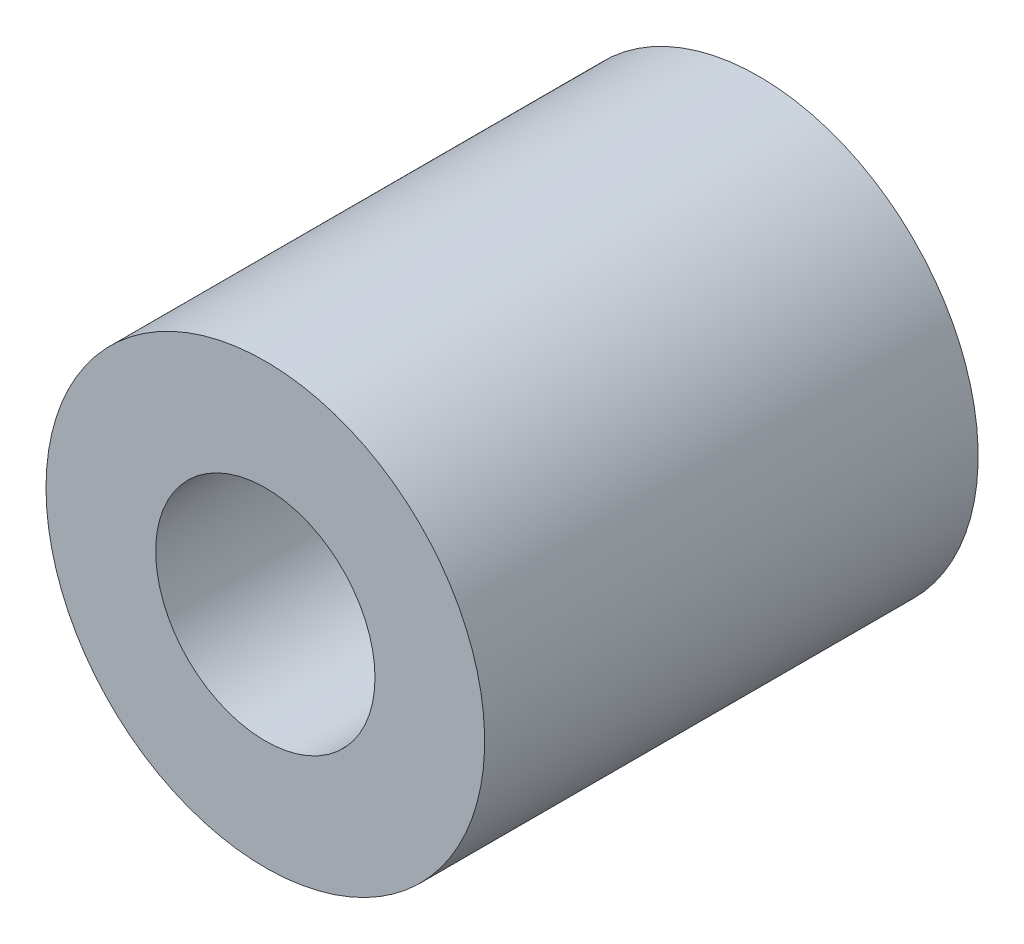
ISO-10303-21;
HEADER;
FILE_DESCRIPTION(('STEP AP214'),'2;1');
FILE_NAME('part.step','',(''),(''),'','','');
FILE_SCHEMA(('AUTOMOTIVE_DESIGN { 1 0 10303 214 1 1 1 1 }'));
ENDSEC;
DATA;
#1=APPLICATION_CONTEXT('core data for automotive mechanical design processes');
#2=APPLICATION_PROTOCOL_DEFINITION('international standard','automotive_design',2000,#1);
#3=PRODUCT_CONTEXT('',#1,'mechanical');
#4=PRODUCT('Part','Part','',(#3));
#5=PRODUCT_RELATED_PRODUCT_CATEGORY('part','',(#4));
#6=PRODUCT_DEFINITION_FORMATION('','',#4);
#7=PRODUCT_DEFINITION_CONTEXT('part definition',#1,'design');
#8=PRODUCT_DEFINITION('design','',#6,#7);
#9=PRODUCT_DEFINITION_SHAPE('','',#8);
#10=(LENGTH_UNIT() NAMED_UNIT(*) SI_UNIT(.MILLI.,.METRE.));
#11=(NAMED_UNIT(*) PLANE_ANGLE_UNIT() SI_UNIT($,.RADIAN.));
#12=(NAMED_UNIT(*) SI_UNIT($,.STERADIAN.) SOLID_ANGLE_UNIT());
#13=UNCERTAINTY_MEASURE_WITH_UNIT(LENGTH_MEASURE(1.E-05),#10,'distance_accuracy_value','');
#14=(GEOMETRIC_REPRESENTATION_CONTEXT(3) GLOBAL_UNCERTAINTY_ASSIGNED_CONTEXT((#13)) GLOBAL_UNIT_ASSIGNED_CONTEXT((#10,
#11,#12)) REPRESENTATION_CONTEXT('',''));
#15=CARTESIAN_POINT('',(0.,0.,0.));
#16=DIRECTION('',(0.,0.,1.));
#17=DIRECTION('',(1.,0.,0.));
#18=AXIS2_PLACEMENT_3D('',#15,#16,#17);
#19=CARTESIAN_POINT('',(0.,0.,9.));
#20=DIRECTION('',(0.,0.,-1.));
#21=DIRECTION('',(-1.,0.,0.));
#22=AXIS2_PLACEMENT_3D('',#19,#20,#21);
#23=PLANE('',#22);
#24=CARTESIAN_POINT('',(0.,0.,9.));
#25=DIRECTION('',(0.,0.,1.));
#26=DIRECTION('',(-1.,0.,0.));
#27=AXIS2_PLACEMENT_3D('',#24,#25,#26);
#28=CIRCLE('',#27,4.);
#29=CARTESIAN_POINT('',(-4.,0.,9.));
#30=VERTEX_POINT('',#29);
#31=EDGE_CURVE('E10',#30,#30,#28,.T.);
#32=ORIENTED_EDGE('',*,*,#31,.T.);
#33=EDGE_LOOP('',(#32));
#34=FACE_BOUND('',#33,.T.);
#35=CARTESIAN_POINT('',(0.,0.,9.));
#36=DIRECTION('',(0.,0.,1.));
#37=DIRECTION('',(1.,0.,0.));
#38=AXIS2_PLACEMENT_3D('',#35,#36,#37);
#39=CIRCLE('',#38,2.);
#40=CARTESIAN_POINT('',(2.,0.,9.));
#41=VERTEX_POINT('',#40);
#42=EDGE_CURVE('E50',#41,#41,#39,.T.);
#43=ORIENTED_EDGE('',*,*,#42,.F.);
#44=EDGE_LOOP('',(#43));
#45=FACE_BOUND('',#44,.T.);
#46=ADVANCED_FACE('F37',(#34,#45),#23,.F.);
#47=CARTESIAN_POINT('',(0.,0.,0.));
#48=DIRECTION('',(0.,0.,-1.));
#49=DIRECTION('',(-1.,0.,0.));
#50=AXIS2_PLACEMENT_3D('',#47,#48,#49);
#51=PLANE('',#50);
#52=CARTESIAN_POINT('',(0.,0.,0.));
#53=DIRECTION('',(0.,0.,1.));
#54=DIRECTION('',(-1.,0.,0.));
#55=AXIS2_PLACEMENT_3D('',#52,#53,#54);
#56=CIRCLE('',#55,4.);
#57=CARTESIAN_POINT('',(-4.,0.,0.));
#58=VERTEX_POINT('',#57);
#59=EDGE_CURVE('E41',#58,#58,#56,.T.);
#60=ORIENTED_EDGE('',*,*,#59,.F.);
#61=EDGE_LOOP('',(#60));
#62=FACE_BOUND('',#61,.T.);
#63=CARTESIAN_POINT('',(0.,0.,0.));
#64=DIRECTION('',(0.,0.,1.));
#65=DIRECTION('',(1.,0.,0.));
#66=AXIS2_PLACEMENT_3D('',#63,#64,#65);
#67=CIRCLE('',#66,2.);
#68=CARTESIAN_POINT('',(2.,0.,0.));
#69=VERTEX_POINT('',#68);
#70=EDGE_CURVE('E52',#69,#69,#67,.T.);
#71=ORIENTED_EDGE('',*,*,#70,.T.);
#72=EDGE_LOOP('',(#71));
#73=FACE_BOUND('',#72,.T.);
#74=ADVANCED_FACE('F64',(#62,#73),#51,.T.);
#75=CARTESIAN_POINT('',(0.,0.,9.));
#76=DIRECTION('',(0.,0.,-1.));
#77=DIRECTION('',(-1.,0.,0.));
#78=AXIS2_PLACEMENT_3D('',#75,#76,#77);
#79=CYLINDRICAL_SURFACE('',#78,4.);
#80=ORIENTED_EDGE('',*,*,#31,.F.);
#81=EDGE_LOOP('',(#80));
#82=FACE_BOUND('',#81,.T.);
#83=ORIENTED_EDGE('',*,*,#59,.T.);
#84=EDGE_LOOP('',(#83));
#85=FACE_BOUND('',#84,.T.);
#86=ADVANCED_FACE('F39',(#82,#85),#79,.T.);
#87=CARTESIAN_POINT('',(0.,0.,9.));
#88=DIRECTION('',(0.,0.,-1.));
#89=DIRECTION('',(-1.,0.,0.));
#90=AXIS2_PLACEMENT_3D('',#87,#88,#89);
#91=CYLINDRICAL_SURFACE('',#90,2.);
#92=ORIENTED_EDGE('',*,*,#42,.T.);
#93=EDGE_LOOP('',(#92));
#94=FACE_BOUND('',#93,.T.);
#95=ORIENTED_EDGE('',*,*,#70,.F.);
#96=EDGE_LOOP('',(#95));
#97=FACE_BOUND('',#96,.T.);
#98=ADVANCED_FACE('F60',(#94,#97),#91,.F.);
#99=CLOSED_SHELL('',(#46,#74,#86,#98));
#100=MANIFOLD_SOLID_BREP('B2',#99);
#101=ADVANCED_BREP_SHAPE_REPRESENTATION('',(#18,#100),#14);
#102=SHAPE_DEFINITION_REPRESENTATION(#9,#101);
ENDSEC;
END-ISO-10303-21;
